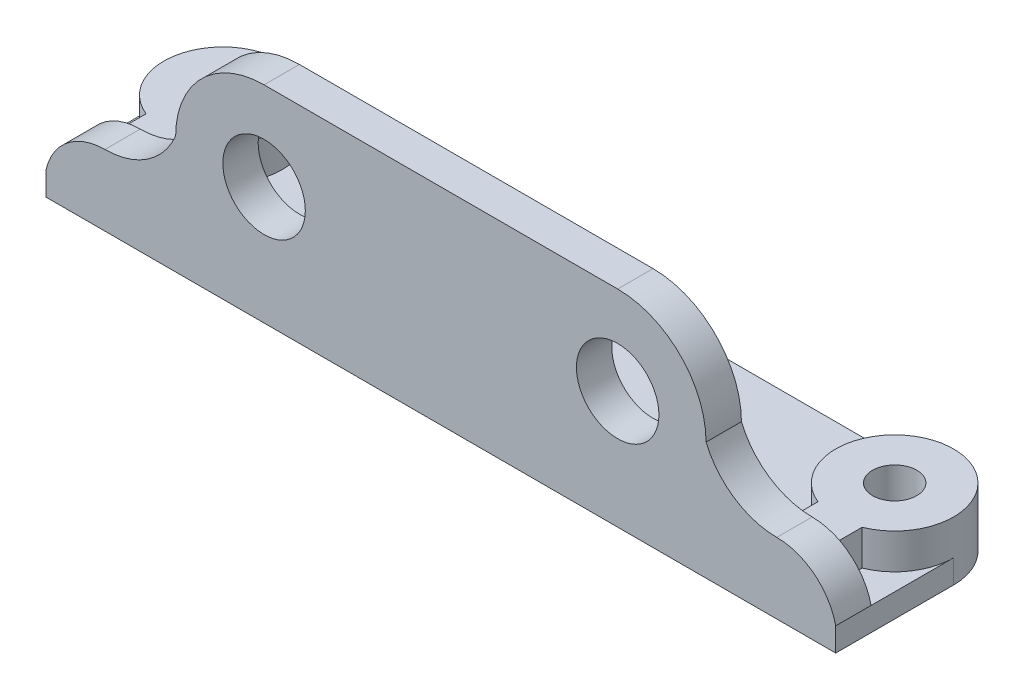
ISO-10303-21;
HEADER;
FILE_DESCRIPTION(('STEP AP214'),'2;1');
FILE_NAME('part.step','',(''),(''),'','','');
FILE_SCHEMA(('AUTOMOTIVE_DESIGN { 1 0 10303 214 1 1 1 1 }'));
ENDSEC;
DATA;
#1=APPLICATION_CONTEXT('core data for automotive mechanical design processes');
#2=APPLICATION_PROTOCOL_DEFINITION('international standard','automotive_design',2000,#1);
#3=PRODUCT_CONTEXT('',#1,'mechanical');
#4=PRODUCT('Part','Part','',(#3));
#5=PRODUCT_RELATED_PRODUCT_CATEGORY('part','',(#4));
#6=PRODUCT_DEFINITION_FORMATION('','',#4);
#7=PRODUCT_DEFINITION_CONTEXT('part definition',#1,'design');
#8=PRODUCT_DEFINITION('design','',#6,#7);
#9=PRODUCT_DEFINITION_SHAPE('','',#8);
#10=(LENGTH_UNIT() NAMED_UNIT(*) SI_UNIT(.MILLI.,.METRE.));
#11=(NAMED_UNIT(*) PLANE_ANGLE_UNIT() SI_UNIT($,.RADIAN.));
#12=(NAMED_UNIT(*) SI_UNIT($,.STERADIAN.) SOLID_ANGLE_UNIT());
#13=UNCERTAINTY_MEASURE_WITH_UNIT(LENGTH_MEASURE(1.E-05),#10,'distance_accuracy_value','');
#14=(GEOMETRIC_REPRESENTATION_CONTEXT(3) GLOBAL_UNCERTAINTY_ASSIGNED_CONTEXT((#13)) GLOBAL_UNIT_ASSIGNED_CONTEXT((#10,
#11,#12)) REPRESENTATION_CONTEXT('',''));
#15=CARTESIAN_POINT('',(0.,0.,0.));
#16=DIRECTION('',(0.,0.,1.));
#17=DIRECTION('',(1.,0.,0.));
#18=AXIS2_PLACEMENT_3D('',#15,#16,#17);
#19=CARTESIAN_POINT('',(-5.,2.,0.));
#20=DIRECTION('',(1.,0.,0.));
#21=DIRECTION('',(0.,0.,-1.));
#22=AXIS2_PLACEMENT_3D('',#19,#20,#21);
#23=PLANE('',#22);
#24=DIRECTION('',(0.,0.,1.));
#25=VECTOR('',#24,1.);
#26=CARTESIAN_POINT('',(-5.,2.,-5.001));
#27=LINE('',#26,#25);
#28=CARTESIAN_POINT('',(-5.,2.,7.));
#29=VERTEX_POINT('',#28);
#30=CARTESIAN_POINT('',(-5.,2.,10.));
#31=VERTEX_POINT('',#30);
#32=EDGE_CURVE('E297',#29,#31,#27,.T.);
#33=ORIENTED_EDGE('',*,*,#32,.F.);
#34=DIRECTION('',(0.,0.,1.));
#35=VECTOR('',#34,1.);
#36=CARTESIAN_POINT('',(-5.,2.,0.));
#37=LINE('',#36,#35);
#38=CARTESIAN_POINT('',(-5.,2.,0.));
#39=VERTEX_POINT('',#38);
#40=EDGE_CURVE('E454',#39,#29,#37,.T.);
#41=ORIENTED_EDGE('',*,*,#40,.F.);
#42=DIRECTION('',(0.,-1.,0.));
#43=VECTOR('',#42,1.);
#44=CARTESIAN_POINT('',(-5.,2.,0.));
#45=LINE('',#44,#43);
#46=CARTESIAN_POINT('',(-5.,0.,0.));
#47=VERTEX_POINT('',#46);
#48=EDGE_CURVE('E502',#39,#47,#45,.T.);
#49=ORIENTED_EDGE('',*,*,#48,.T.);
#50=DIRECTION('',(0.,0.,1.));
#51=VECTOR('',#50,1.);
#52=CARTESIAN_POINT('',(-5.,0.,0.));
#53=LINE('',#52,#51);
#54=CARTESIAN_POINT('',(-5.,0.,10.));
#55=VERTEX_POINT('',#54);
#56=EDGE_CURVE('E475',#47,#55,#53,.T.);
#57=ORIENTED_EDGE('',*,*,#56,.T.);
#58=DIRECTION('',(0.,-1.,0.));
#59=VECTOR('',#58,1.);
#60=CARTESIAN_POINT('',(-5.,2.,10.));
#61=LINE('',#60,#59);
#62=EDGE_CURVE('E499',#31,#55,#61,.T.);
#63=ORIENTED_EDGE('',*,*,#62,.F.);
#64=EDGE_LOOP('',(#33,#41,#49,#57,#63));
#65=FACE_BOUND('',#64,.T.);
#66=ADVANCED_FACE('F107',(#65),#23,.F.);
#67=CARTESIAN_POINT('',(0.,2.,10.));
#68=DIRECTION('',(0.,0.,-1.));
#69=DIRECTION('',(-1.,0.,0.));
#70=AXIS2_PLACEMENT_3D('',#67,#68,#69);
#71=PLANE('',#70);
#72=CARTESIAN_POINT('',(13.5,10.,10.));
#73=DIRECTION('',(0.,0.,1.));
#74=DIRECTION('',(1.,0.,0.));
#75=AXIS2_PLACEMENT_3D('',#72,#73,#74);
#76=CIRCLE('',#75,3.5);
#77=CARTESIAN_POINT('',(17.,10.,10.));
#78=VERTEX_POINT('',#77);
#79=EDGE_CURVE('E348',#78,#78,#76,.T.);
#80=ORIENTED_EDGE('',*,*,#79,.F.);
#81=EDGE_LOOP('',(#80));
#82=FACE_BOUND('',#81,.T.);
#83=DIRECTION('',(0.,-1.,0.));
#84=VECTOR('',#83,1.);
#85=CARTESIAN_POINT('',(62.,2.,10.));
#86=LINE('',#85,#84);
#87=CARTESIAN_POINT('',(62.,2.,10.));
#88=VERTEX_POINT('',#87);
#89=CARTESIAN_POINT('',(62.,0.,10.));
#90=VERTEX_POINT('',#89);
#91=EDGE_CURVE('E496',#88,#90,#86,.T.);
#92=ORIENTED_EDGE('',*,*,#91,.F.);
#93=CARTESIAN_POINT('',(57.,0.875000000000001,10.));
#94=DIRECTION('',(0.,0.,1.));
#95=DIRECTION('',(1.,0.,0.));
#96=AXIS2_PLACEMENT_3D('',#93,#94,#95);
#97=CIRCLE('',#96,5.125);
#98=CARTESIAN_POINT('',(57.,6.,10.));
#99=VERTEX_POINT('',#98);
#100=EDGE_CURVE('E285',#99,#88,#97,.F.);
#101=ORIENTED_EDGE('',*,*,#100,.F.);
#102=CARTESIAN_POINT('',(57.,12.5,10.));
#103=DIRECTION('',(0.,0.,1.));
#104=DIRECTION('',(1.,0.,0.));
#105=AXIS2_PLACEMENT_3D('',#102,#103,#104);
#106=CIRCLE('',#105,6.50000000000001);
#107=CARTESIAN_POINT('',(51.,10.,10.));
#108=VERTEX_POINT('',#107);
#109=EDGE_CURVE('E292',#99,#108,#106,.F.);
#110=ORIENTED_EDGE('',*,*,#109,.T.);
#111=CARTESIAN_POINT('',(43.5,10.,10.));
#112=DIRECTION('',(0.,0.,1.));
#113=DIRECTION('',(1.,0.,0.));
#114=AXIS2_PLACEMENT_3D('',#111,#112,#113);
#115=CIRCLE('',#114,7.5);
#116=CARTESIAN_POINT('',(43.5,17.5,10.));
#117=VERTEX_POINT('',#116);
#118=EDGE_CURVE('E272',#117,#108,#115,.F.);
#119=ORIENTED_EDGE('',*,*,#118,.F.);
#120=DIRECTION('',(1.,0.,0.));
#121=VECTOR('',#120,1.);
#122=CARTESIAN_POINT('',(0.,17.5,10.));
#123=LINE('',#122,#121);
#124=CARTESIAN_POINT('',(13.5,17.5,10.));
#125=VERTEX_POINT('',#124);
#126=EDGE_CURVE('E325',#125,#117,#123,.T.);
#127=ORIENTED_EDGE('',*,*,#126,.F.);
#128=CARTESIAN_POINT('',(13.5,10.,10.));
#129=DIRECTION('',(0.,0.,1.));
#130=DIRECTION('',(1.,0.,0.));
#131=AXIS2_PLACEMENT_3D('',#128,#129,#130);
#132=CIRCLE('',#131,7.5);
#133=CARTESIAN_POINT('',(6.00000000000001,10.,10.));
#134=VERTEX_POINT('',#133);
#135=EDGE_CURVE('E312',#125,#134,#132,.T.);
#136=ORIENTED_EDGE('',*,*,#135,.T.);
#137=CARTESIAN_POINT('',(0.,12.5,10.));
#138=DIRECTION('',(0.,0.,1.));
#139=DIRECTION('',(1.,0.,0.));
#140=AXIS2_PLACEMENT_3D('',#137,#138,#139);
#141=CIRCLE('',#140,6.50000000000001);
#142=CARTESIAN_POINT('',(0.,6.,10.));
#143=VERTEX_POINT('',#142);
#144=EDGE_CURVE('E281',#143,#134,#141,.T.);
#145=ORIENTED_EDGE('',*,*,#144,.F.);
#146=CARTESIAN_POINT('',(0.,0.875000000000001,10.));
#147=DIRECTION('',(0.,0.,1.));
#148=DIRECTION('',(1.,0.,0.));
#149=AXIS2_PLACEMENT_3D('',#146,#147,#148);
#150=CIRCLE('',#149,5.125);
#151=EDGE_CURVE('E304',#143,#31,#150,.T.);
#152=ORIENTED_EDGE('',*,*,#151,.T.);
#153=ORIENTED_EDGE('',*,*,#62,.T.);
#154=DIRECTION('',(1.,0.,0.));
#155=VECTOR('',#154,1.);
#156=CARTESIAN_POINT('',(0.,0.,10.));
#157=LINE('',#156,#155);
#158=EDGE_CURVE('E479',#55,#90,#157,.T.);
#159=ORIENTED_EDGE('',*,*,#158,.T.);
#160=EDGE_LOOP('',(#92,#101,#110,#119,#127,#136,#145,#152,#153,#159));
#161=FACE_BOUND('',#160,.T.);
#162=CARTESIAN_POINT('',(43.5,10.,10.));
#163=DIRECTION('',(0.,0.,1.));
#164=DIRECTION('',(1.,0.,0.));
#165=AXIS2_PLACEMENT_3D('',#162,#163,#164);
#166=CIRCLE('',#165,3.5);
#167=CARTESIAN_POINT('',(47.,10.,10.));
#168=VERTEX_POINT('',#167);
#169=EDGE_CURVE('E335',#168,#168,#166,.F.);
#170=ORIENTED_EDGE('',*,*,#169,.T.);
#171=EDGE_LOOP('',(#170));
#172=FACE_BOUND('',#171,.T.);
#173=ADVANCED_FACE('F548',(#82,#161,#172),#71,.F.);
#174=CARTESIAN_POINT('',(0.,5.,7.));
#175=DIRECTION('',(0.,0.,-1.));
#176=DIRECTION('',(-1.,0.,0.));
#177=AXIS2_PLACEMENT_3D('',#174,#175,#176);
#178=PLANE('',#177);
#179=CARTESIAN_POINT('',(13.5,10.,7.));
#180=DIRECTION('',(0.,0.,-1.));
#181=DIRECTION('',(-1.,0.,0.));
#182=AXIS2_PLACEMENT_3D('',#179,#180,#181);
#183=CIRCLE('',#182,3.5);
#184=CARTESIAN_POINT('',(10.,10.,7.));
#185=VERTEX_POINT('',#184);
#186=EDGE_CURVE('E347',#185,#185,#183,.F.);
#187=ORIENTED_EDGE('',*,*,#186,.T.);
#188=EDGE_LOOP('',(#187));
#189=FACE_BOUND('',#188,.T.);
#190=CARTESIAN_POINT('',(57.,0.875000000000001,7.));
#191=DIRECTION('',(0.,0.,-1.));
#192=DIRECTION('',(-1.,0.,0.));
#193=AXIS2_PLACEMENT_3D('',#190,#191,#192);
#194=CIRCLE('',#193,5.125);
#195=CARTESIAN_POINT('',(57.,6.,7.));
#196=VERTEX_POINT('',#195);
#197=CARTESIAN_POINT('',(62.,2.,7.));
#198=VERTEX_POINT('',#197);
#199=EDGE_CURVE('E298',#196,#198,#194,.T.);
#200=ORIENTED_EDGE('',*,*,#199,.T.);
#201=DIRECTION('',(1.,0.,0.));
#202=VECTOR('',#201,1.);
#203=CARTESIAN_POINT('',(0.,2.,7.));
#204=LINE('',#203,#202);
#205=CARTESIAN_POINT('',(58.875,2.,7.));
#206=VERTEX_POINT('',#205);
#207=EDGE_CURVE('E413',#206,#198,#204,.T.);
#208=ORIENTED_EDGE('',*,*,#207,.F.);
#209=DIRECTION('',(0.,-1.,0.));
#210=VECTOR('',#209,1.);
#211=CARTESIAN_POINT('',(58.875,5.,7.));
#212=LINE('',#211,#210);
#213=CARTESIAN_POINT('',(58.875,5.,7.));
#214=VERTEX_POINT('',#213);
#215=EDGE_CURVE('E421',#214,#206,#212,.T.);
#216=ORIENTED_EDGE('',*,*,#215,.F.);
#217=DIRECTION('',(-1.,0.,0.));
#218=VECTOR('',#217,1.);
#219=CARTESIAN_POINT('',(-5.,5.,7.));
#220=LINE('',#219,#218);
#221=CARTESIAN_POINT('',(55.125,5.,7.));
#222=VERTEX_POINT('',#221);
#223=EDGE_CURVE('E12',#214,#222,#220,.T.);
#224=ORIENTED_EDGE('',*,*,#223,.T.);
#225=DIRECTION('',(0.,-1.,0.));
#226=VECTOR('',#225,1.);
#227=CARTESIAN_POINT('',(55.125,5.,7.));
#228=LINE('',#227,#226);
#229=CARTESIAN_POINT('',(55.125,2.,7.));
#230=VERTEX_POINT('',#229);
#231=EDGE_CURVE('E441',#222,#230,#228,.T.);
#232=ORIENTED_EDGE('',*,*,#231,.T.);
#233=DIRECTION('',(1.,0.,0.));
#234=VECTOR('',#233,1.);
#235=CARTESIAN_POINT('',(0.,2.,7.));
#236=LINE('',#235,#234);
#237=CARTESIAN_POINT('',(1.875,2.,7.));
#238=VERTEX_POINT('',#237);
#239=EDGE_CURVE('E395',#238,#230,#236,.T.);
#240=ORIENTED_EDGE('',*,*,#239,.F.);
#241=DIRECTION('',(0.,-1.,0.));
#242=VECTOR('',#241,1.);
#243=CARTESIAN_POINT('',(1.875,5.,7.));
#244=LINE('',#243,#242);
#245=CARTESIAN_POINT('',(1.875,5.,7.));
#246=VERTEX_POINT('',#245);
#247=EDGE_CURVE('E437',#246,#238,#244,.T.);
#248=ORIENTED_EDGE('',*,*,#247,.F.);
#249=CARTESIAN_POINT('',(-1.875,5.,7.));
#250=VERTEX_POINT('',#249);
#251=EDGE_CURVE('E117',#246,#250,#220,.T.);
#252=ORIENTED_EDGE('',*,*,#251,.T.);
#253=DIRECTION('',(0.,-1.,0.));
#254=VECTOR('',#253,1.);
#255=CARTESIAN_POINT('',(-1.875,5.,7.));
#256=LINE('',#255,#254);
#257=CARTESIAN_POINT('',(-1.875,2.,7.));
#258=VERTEX_POINT('',#257);
#259=EDGE_CURVE('E425',#250,#258,#256,.T.);
#260=ORIENTED_EDGE('',*,*,#259,.T.);
#261=DIRECTION('',(1.,0.,0.));
#262=VECTOR('',#261,1.);
#263=CARTESIAN_POINT('',(0.,2.,7.));
#264=LINE('',#263,#262);
#265=EDGE_CURVE('E410',#29,#258,#264,.T.);
#266=ORIENTED_EDGE('',*,*,#265,.F.);
#267=CARTESIAN_POINT('',(0.,0.875000000000001,7.));
#268=DIRECTION('',(0.,0.,-1.));
#269=DIRECTION('',(-1.,0.,0.));
#270=AXIS2_PLACEMENT_3D('',#267,#268,#269);
#271=CIRCLE('',#270,5.125);
#272=CARTESIAN_POINT('',(0.,6.,7.));
#273=VERTEX_POINT('',#272);
#274=EDGE_CURVE('E265',#273,#29,#271,.F.);
#275=ORIENTED_EDGE('',*,*,#274,.F.);
#276=CARTESIAN_POINT('',(0.,12.5,7.));
#277=DIRECTION('',(0.,0.,-1.));
#278=DIRECTION('',(-1.,0.,0.));
#279=AXIS2_PLACEMENT_3D('',#276,#277,#278);
#280=CIRCLE('',#279,6.50000000000001);
#281=CARTESIAN_POINT('',(6.00000000000001,10.,7.));
#282=VERTEX_POINT('',#281);
#283=EDGE_CURVE('E309',#273,#282,#280,.F.);
#284=ORIENTED_EDGE('',*,*,#283,.T.);
#285=CARTESIAN_POINT('',(13.5,10.,7.));
#286=DIRECTION('',(0.,0.,-1.));
#287=DIRECTION('',(-1.,0.,0.));
#288=AXIS2_PLACEMENT_3D('',#285,#286,#287);
#289=CIRCLE('',#288,7.5);
#290=CARTESIAN_POINT('',(13.5,17.5,7.));
#291=VERTEX_POINT('',#290);
#292=EDGE_CURVE('E264',#291,#282,#289,.F.);
#293=ORIENTED_EDGE('',*,*,#292,.F.);
#294=DIRECTION('',(1.,0.,0.));
#295=VECTOR('',#294,1.);
#296=CARTESIAN_POINT('',(0.,17.5,7.));
#297=LINE('',#296,#295);
#298=CARTESIAN_POINT('',(43.5,17.5,7.));
#299=VERTEX_POINT('',#298);
#300=EDGE_CURVE('E279',#291,#299,#297,.T.);
#301=ORIENTED_EDGE('',*,*,#300,.T.);
#302=CARTESIAN_POINT('',(43.5,10.,7.));
#303=DIRECTION('',(0.,0.,-1.));
#304=DIRECTION('',(-1.,0.,0.));
#305=AXIS2_PLACEMENT_3D('',#302,#303,#304);
#306=CIRCLE('',#305,7.5);
#307=CARTESIAN_POINT('',(51.,10.,7.));
#308=VERTEX_POINT('',#307);
#309=EDGE_CURVE('E269',#299,#308,#306,.T.);
#310=ORIENTED_EDGE('',*,*,#309,.T.);
#311=CARTESIAN_POINT('',(57.,12.5,7.));
#312=DIRECTION('',(0.,0.,-1.));
#313=DIRECTION('',(-1.,0.,0.));
#314=AXIS2_PLACEMENT_3D('',#311,#312,#313);
#315=CIRCLE('',#314,6.50000000000001);
#316=EDGE_CURVE('E253',#196,#308,#315,.T.);
#317=ORIENTED_EDGE('',*,*,#316,.F.);
#318=EDGE_LOOP('',(#200,#208,#216,#224,#232,#240,#248,#252,#260,#266,#275,#284,#293,#301,#310,#317));
#319=FACE_BOUND('',#318,.T.);
#320=CARTESIAN_POINT('',(43.5,10.,7.));
#321=DIRECTION('',(0.,0.,-1.));
#322=DIRECTION('',(-1.,0.,0.));
#323=AXIS2_PLACEMENT_3D('',#320,#321,#322);
#324=CIRCLE('',#323,3.5);
#325=CARTESIAN_POINT('',(40.,10.,7.));
#326=VERTEX_POINT('',#325);
#327=EDGE_CURVE('E343',#326,#326,#324,.T.);
#328=ORIENTED_EDGE('',*,*,#327,.F.);
#329=EDGE_LOOP('',(#328));
#330=FACE_BOUND('',#329,.T.);
#331=ADVANCED_FACE('F276',(#189,#319,#330),#178,.T.);
#332=CARTESIAN_POINT('',(0.,5.,0.));
#333=DIRECTION('',(0.,1.,0.));
#334=DIRECTION('',(0.,0.,1.));
#335=AXIS2_PLACEMENT_3D('',#332,#333,#334);
#336=PLANE('',#335);
#337=ORIENTED_EDGE('',*,*,#223,.F.);
#338=DIRECTION('',(0.,0.,1.));
#339=VECTOR('',#338,1.);
#340=CARTESIAN_POINT('',(58.875,5.,0.));
#341=LINE('',#340,#339);
#342=CARTESIAN_POINT('',(58.875,5.,4.63512405443478));
#343=VERTEX_POINT('',#342);
#344=EDGE_CURVE('E375',#343,#214,#341,.T.);
#345=ORIENTED_EDGE('',*,*,#344,.F.);
#346=CARTESIAN_POINT('',(57.,5.,0.));
#347=DIRECTION('',(0.,1.,0.));
#348=DIRECTION('',(0.,0.,1.));
#349=AXIS2_PLACEMENT_3D('',#346,#347,#348);
#350=CIRCLE('',#349,5.);
#351=CARTESIAN_POINT('',(55.125,5.,4.63512405443479));
#352=VERTEX_POINT('',#351);
#353=EDGE_CURVE('E355',#343,#352,#350,.T.);
#354=ORIENTED_EDGE('',*,*,#353,.T.);
#355=DIRECTION('',(0.,0.,1.));
#356=VECTOR('',#355,1.);
#357=CARTESIAN_POINT('',(55.125,5.,0.));
#358=LINE('',#357,#356);
#359=EDGE_CURVE('E359',#352,#222,#358,.T.);
#360=ORIENTED_EDGE('',*,*,#359,.T.);
#361=EDGE_LOOP('',(#337,#345,#354,#360));
#362=FACE_BOUND('',#361,.T.);
#363=CARTESIAN_POINT('',(57.,5.,0.));
#364=DIRECTION('',(0.,1.,0.));
#365=DIRECTION('',(0.,0.,1.));
#366=AXIS2_PLACEMENT_3D('',#363,#364,#365);
#367=CIRCLE('',#366,1.875);
#368=CARTESIAN_POINT('',(57.,5.,1.875));
#369=VERTEX_POINT('',#368);
#370=EDGE_CURVE('E379',#369,#369,#367,.F.);
#371=ORIENTED_EDGE('',*,*,#370,.T.);
#372=EDGE_LOOP('',(#371));
#373=FACE_BOUND('',#372,.T.);
#374=ADVANCED_FACE('F577',(#362,#373),#336,.T.);
#375=CARTESIAN_POINT('',(0.,2.,0.));
#376=DIRECTION('',(0.,1.,0.));
#377=DIRECTION('',(0.,0.,1.));
#378=AXIS2_PLACEMENT_3D('',#375,#376,#377);
#379=PLANE('',#378);
#380=ORIENTED_EDGE('',*,*,#40,.T.);
#381=ORIENTED_EDGE('',*,*,#265,.T.);
#382=DIRECTION('',(0.,0.,1.));
#383=VECTOR('',#382,1.);
#384=CARTESIAN_POINT('',(-1.875,2.,0.));
#385=LINE('',#384,#383);
#386=CARTESIAN_POINT('',(-1.875,2.,4.63512405443479));
#387=VERTEX_POINT('',#386);
#388=EDGE_CURVE('E405',#387,#258,#385,.T.);
#389=ORIENTED_EDGE('',*,*,#388,.F.);
#390=CARTESIAN_POINT('',(0.,2.,0.));
#391=DIRECTION('',(0.,1.,0.));
#392=DIRECTION('',(0.,0.,1.));
#393=AXIS2_PLACEMENT_3D('',#390,#391,#392);
#394=CIRCLE('',#393,5.);
#395=EDGE_CURVE('E406',#39,#387,#394,.T.);
#396=ORIENTED_EDGE('',*,*,#395,.F.);
#397=EDGE_LOOP('',(#380,#381,#389,#396));
#398=FACE_BOUND('',#397,.T.);
#399=ADVANCED_FACE('F534',(#398),#379,.T.);
#400=CARTESIAN_POINT('',(57.,2.,0.));
#401=DIRECTION('',(0.,1.,0.));
#402=DIRECTION('',(0.,0.,1.));
#403=AXIS2_PLACEMENT_3D('',#400,#401,#402);
#404=CIRCLE('',#403,5.);
#405=CARTESIAN_POINT('',(58.875,2.,4.63512405443478));
#406=VERTEX_POINT('',#405);
#407=CARTESIAN_POINT('',(62.,2.,0.));
#408=VERTEX_POINT('',#407);
#409=EDGE_CURVE('E133',#406,#408,#404,.T.);
#410=ORIENTED_EDGE('',*,*,#409,.F.);
#411=DIRECTION('',(0.,0.,1.));
#412=VECTOR('',#411,1.);
#413=CARTESIAN_POINT('',(58.875,2.,0.));
#414=LINE('',#413,#412);
#415=EDGE_CURVE('E360',#406,#206,#414,.T.);
#416=ORIENTED_EDGE('',*,*,#415,.T.);
#417=ORIENTED_EDGE('',*,*,#207,.T.);
#418=DIRECTION('',(0.,0.,1.));
#419=VECTOR('',#418,1.);
#420=CARTESIAN_POINT('',(62.,2.,0.));
#421=LINE('',#420,#419);
#422=EDGE_CURVE('E459',#408,#198,#421,.T.);
#423=ORIENTED_EDGE('',*,*,#422,.F.);
#424=EDGE_LOOP('',(#410,#416,#417,#423));
#425=FACE_BOUND('',#424,.T.);
#426=ADVANCED_FACE('F566',(#425),#379,.T.);
#427=CARTESIAN_POINT('',(57.,2.,0.));
#428=DIRECTION('',(0.,-1.,0.));
#429=DIRECTION('',(0.,0.,-1.));
#430=AXIS2_PLACEMENT_3D('',#427,#428,#429);
#431=CYLINDRICAL_SURFACE('',#430,5.);
#432=CARTESIAN_POINT('',(57.,0.,0.));
#433=DIRECTION('',(0.,1.,0.));
#434=DIRECTION('',(0.,0.,1.));
#435=AXIS2_PLACEMENT_3D('',#432,#433,#434);
#436=CIRCLE('',#435,5.);
#437=CARTESIAN_POINT('',(62.,0.,0.));
#438=VERTEX_POINT('',#437);
#439=CARTESIAN_POINT('',(57.,0.,-5.));
#440=VERTEX_POINT('',#439);
#441=EDGE_CURVE('E449',#438,#440,#436,.T.);
#442=ORIENTED_EDGE('',*,*,#441,.T.);
#443=DIRECTION('',(0.,-1.,0.));
#444=VECTOR('',#443,1.);
#445=CARTESIAN_POINT('',(57.,2.,-5.));
#446=LINE('',#445,#444);
#447=CARTESIAN_POINT('',(57.,2.,-5.));
#448=VERTEX_POINT('',#447);
#449=EDGE_CURVE('E111',#448,#440,#446,.T.);
#450=ORIENTED_EDGE('',*,*,#449,.F.);
#451=CARTESIAN_POINT('',(55.125,2.,4.63512405443479));
#452=VERTEX_POINT('',#451);
#453=EDGE_CURVE('E391',#448,#452,#404,.T.);
#454=ORIENTED_EDGE('',*,*,#453,.T.);
#455=DIRECTION('',(0.,-1.,0.));
#456=VECTOR('',#455,1.);
#457=CARTESIAN_POINT('',(55.125,5.,4.63512405443479));
#458=LINE('',#457,#456);
#459=EDGE_CURVE('E445',#352,#452,#458,.T.);
#460=ORIENTED_EDGE('',*,*,#459,.F.);
#461=ORIENTED_EDGE('',*,*,#353,.F.);
#462=DIRECTION('',(0.,-1.,0.));
#463=VECTOR('',#462,1.);
#464=CARTESIAN_POINT('',(58.875,5.,4.63512405443478));
#465=LINE('',#464,#463);
#466=EDGE_CURVE('E387',#343,#406,#465,.T.);
#467=ORIENTED_EDGE('',*,*,#466,.T.);
#468=ORIENTED_EDGE('',*,*,#409,.T.);
#469=DIRECTION('',(0.,-1.,0.));
#470=VECTOR('',#469,1.);
#471=CARTESIAN_POINT('',(62.,2.,0.));
#472=LINE('',#471,#470);
#473=EDGE_CURVE('E463',#408,#438,#472,.T.);
#474=ORIENTED_EDGE('',*,*,#473,.T.);
#475=EDGE_LOOP('',(#442,#450,#454,#460,#461,#467,#468,#474));
#476=FACE_BOUND('',#475,.T.);
#477=ADVANCED_FACE('F109',(#476),#431,.T.);
#478=CARTESIAN_POINT('',(0.,2.,-5.));
#479=DIRECTION('',(0.,0.,-1.));
#480=DIRECTION('',(-1.,0.,0.));
#481=AXIS2_PLACEMENT_3D('',#478,#479,#480);
#482=PLANE('',#481);
#483=DIRECTION('',(1.,0.,0.));
#484=VECTOR('',#483,1.);
#485=CARTESIAN_POINT('',(0.,0.,-5.));
#486=LINE('',#485,#484);
#487=CARTESIAN_POINT('',(0.,0.,-5.));
#488=VERTEX_POINT('',#487);
#489=EDGE_CURVE('E467',#488,#440,#486,.T.);
#490=ORIENTED_EDGE('',*,*,#489,.F.);
#491=DIRECTION('',(0.,-1.,0.));
#492=VECTOR('',#491,1.);
#493=CARTESIAN_POINT('',(0.,2.,-5.));
#494=LINE('',#493,#492);
#495=CARTESIAN_POINT('',(0.,2.,-5.));
#496=VERTEX_POINT('',#495);
#497=EDGE_CURVE('E504',#496,#488,#494,.T.);
#498=ORIENTED_EDGE('',*,*,#497,.F.);
#499=DIRECTION('',(1.,0.,0.));
#500=VECTOR('',#499,1.);
#501=CARTESIAN_POINT('',(0.,2.,-5.));
#502=LINE('',#501,#500);
#503=EDGE_CURVE('E450',#496,#448,#502,.T.);
#504=ORIENTED_EDGE('',*,*,#503,.T.);
#505=ORIENTED_EDGE('',*,*,#449,.T.);
#506=EDGE_LOOP('',(#490,#498,#504,#505));
#507=FACE_BOUND('',#506,.T.);
#508=ADVANCED_FACE('F590',(#507),#482,.T.);
#509=CARTESIAN_POINT('',(0.,2.,0.));
#510=DIRECTION('',(0.,-1.,0.));
#511=DIRECTION('',(0.,0.,-1.));
#512=AXIS2_PLACEMENT_3D('',#509,#510,#511);
#513=CYLINDRICAL_SURFACE('',#512,5.);
#514=CARTESIAN_POINT('',(0.,0.,0.));
#515=DIRECTION('',(0.,1.,0.));
#516=DIRECTION('',(0.,0.,1.));
#517=AXIS2_PLACEMENT_3D('',#514,#515,#516);
#518=CIRCLE('',#517,5.);
#519=EDGE_CURVE('E471',#47,#488,#518,.F.);
#520=ORIENTED_EDGE('',*,*,#519,.F.);
#521=ORIENTED_EDGE('',*,*,#48,.F.);
#522=ORIENTED_EDGE('',*,*,#395,.T.);
#523=DIRECTION('',(0.,-1.,0.));
#524=VECTOR('',#523,1.);
#525=CARTESIAN_POINT('',(-1.875,5.,4.63512405443479));
#526=LINE('',#525,#524);
#527=CARTESIAN_POINT('',(-1.875,5.,4.63512405443479));
#528=VERTEX_POINT('',#527);
#529=EDGE_CURVE('E429',#528,#387,#526,.T.);
#530=ORIENTED_EDGE('',*,*,#529,.F.);
#531=CARTESIAN_POINT('',(0.,5.,0.));
#532=DIRECTION('',(0.,1.,0.));
#533=DIRECTION('',(0.,0.,1.));
#534=AXIS2_PLACEMENT_3D('',#531,#532,#533);
#535=CIRCLE('',#534,5.);
#536=CARTESIAN_POINT('',(1.875,5.,4.63512405443479));
#537=VERTEX_POINT('',#536);
#538=EDGE_CURVE('E368',#537,#528,#535,.T.);
#539=ORIENTED_EDGE('',*,*,#538,.F.);
#540=DIRECTION('',(0.,-1.,0.));
#541=VECTOR('',#540,1.);
#542=CARTESIAN_POINT('',(1.875,5.,4.63512405443479));
#543=LINE('',#542,#541);
#544=CARTESIAN_POINT('',(1.875,2.,4.63512405443479));
#545=VERTEX_POINT('',#544);
#546=EDGE_CURVE('E433',#537,#545,#543,.T.);
#547=ORIENTED_EDGE('',*,*,#546,.T.);
#548=EDGE_CURVE('E401',#545,#496,#394,.T.);
#549=ORIENTED_EDGE('',*,*,#548,.T.);
#550=ORIENTED_EDGE('',*,*,#497,.T.);
#551=EDGE_LOOP('',(#520,#521,#522,#530,#539,#547,#549,#550));
#552=FACE_BOUND('',#551,.T.);
#553=ADVANCED_FACE('F587',(#552),#513,.T.);
#554=CARTESIAN_POINT('',(57.,2.,0.));
#555=DIRECTION('',(0.,-1.,0.));
#556=DIRECTION('',(0.,0.,-1.));
#557=AXIS2_PLACEMENT_3D('',#554,#555,#556);
#558=CYLINDRICAL_SURFACE('',#557,1.875);
#559=CARTESIAN_POINT('',(57.,0.,0.));
#560=DIRECTION('',(0.,1.,0.));
#561=DIRECTION('',(0.,0.,1.));
#562=AXIS2_PLACEMENT_3D('',#559,#560,#561);
#563=CIRCLE('',#562,1.875);
#564=CARTESIAN_POINT('',(57.,0.,1.875));
#565=VERTEX_POINT('',#564);
#566=EDGE_CURVE('E487',#565,#565,#563,.T.);
#567=ORIENTED_EDGE('',*,*,#566,.F.);
#568=EDGE_LOOP('',(#567));
#569=FACE_BOUND('',#568,.T.);
#570=ORIENTED_EDGE('',*,*,#370,.F.);
#571=EDGE_LOOP('',(#570));
#572=FACE_BOUND('',#571,.T.);
#573=ADVANCED_FACE('F589',(#569,#572),#558,.F.);
#574=CARTESIAN_POINT('',(62.,2.,0.));
#575=DIRECTION('',(1.,0.,0.));
#576=DIRECTION('',(0.,0.,-1.));
#577=AXIS2_PLACEMENT_3D('',#574,#575,#576);
#578=PLANE('',#577);
#579=DIRECTION('',(0.,0.,1.));
#580=VECTOR('',#579,1.);
#581=CARTESIAN_POINT('',(62.,2.,-5.001));
#582=LINE('',#581,#580);
#583=EDGE_CURVE('E293',#198,#88,#582,.T.);
#584=ORIENTED_EDGE('',*,*,#583,.T.);
#585=ORIENTED_EDGE('',*,*,#91,.T.);
#586=DIRECTION('',(0.,0.,1.));
#587=VECTOR('',#586,1.);
#588=CARTESIAN_POINT('',(62.,0.,0.));
#589=LINE('',#588,#587);
#590=EDGE_CURVE('E483',#438,#90,#589,.T.);
#591=ORIENTED_EDGE('',*,*,#590,.F.);
#592=ORIENTED_EDGE('',*,*,#473,.F.);
#593=ORIENTED_EDGE('',*,*,#422,.T.);
#594=EDGE_LOOP('',(#584,#585,#591,#592,#593));
#595=FACE_BOUND('',#594,.T.);
#596=ADVANCED_FACE('F564',(#595),#578,.T.);
#597=CARTESIAN_POINT('',(0.,2.,0.));
#598=DIRECTION('',(0.,-1.,0.));
#599=DIRECTION('',(0.,0.,-1.));
#600=AXIS2_PLACEMENT_3D('',#597,#598,#599);
#601=CYLINDRICAL_SURFACE('',#600,1.875);
#602=CARTESIAN_POINT('',(0.,0.,0.));
#603=DIRECTION('',(0.,1.,0.));
#604=DIRECTION('',(0.,0.,1.));
#605=AXIS2_PLACEMENT_3D('',#602,#603,#604);
#606=CIRCLE('',#605,1.875);
#607=CARTESIAN_POINT('',(0.,0.,1.875));
#608=VERTEX_POINT('',#607);
#609=EDGE_CURVE('E455',#608,#608,#606,.T.);
#610=ORIENTED_EDGE('',*,*,#609,.F.);
#611=EDGE_LOOP('',(#610));
#612=FACE_BOUND('',#611,.T.);
#613=CARTESIAN_POINT('',(0.,5.,0.));
#614=DIRECTION('',(0.,1.,0.));
#615=DIRECTION('',(0.,0.,1.));
#616=AXIS2_PLACEMENT_3D('',#613,#614,#615);
#617=CIRCLE('',#616,1.875);
#618=CARTESIAN_POINT('',(0.,5.,1.875));
#619=VERTEX_POINT('',#618);
#620=EDGE_CURVE('E383',#619,#619,#617,.F.);
#621=ORIENTED_EDGE('',*,*,#620,.F.);
#622=EDGE_LOOP('',(#621));
#623=FACE_BOUND('',#622,.T.);
#624=ADVANCED_FACE('F607',(#612,#623),#601,.F.);
#625=ORIENTED_EDGE('',*,*,#453,.F.);
#626=ORIENTED_EDGE('',*,*,#503,.F.);
#627=ORIENTED_EDGE('',*,*,#548,.F.);
#628=DIRECTION('',(0.,0.,1.));
#629=VECTOR('',#628,1.);
#630=CARTESIAN_POINT('',(1.875,2.,0.));
#631=LINE('',#630,#629);
#632=EDGE_CURVE('E398',#545,#238,#631,.T.);
#633=ORIENTED_EDGE('',*,*,#632,.T.);
#634=ORIENTED_EDGE('',*,*,#239,.T.);
#635=DIRECTION('',(0.,0.,1.));
#636=VECTOR('',#635,1.);
#637=CARTESIAN_POINT('',(55.125,2.,0.));
#638=LINE('',#637,#636);
#639=EDGE_CURVE('E390',#452,#230,#638,.T.);
#640=ORIENTED_EDGE('',*,*,#639,.F.);
#641=EDGE_LOOP('',(#625,#626,#627,#633,#634,#640));
#642=FACE_BOUND('',#641,.T.);
#643=ADVANCED_FACE('F582',(#642),#379,.T.);
#644=CARTESIAN_POINT('',(0.,0.,0.));
#645=DIRECTION('',(0.,1.,0.));
#646=DIRECTION('',(0.,0.,1.));
#647=AXIS2_PLACEMENT_3D('',#644,#645,#646);
#648=PLANE('',#647);
#649=ORIENTED_EDGE('',*,*,#441,.F.);
#650=ORIENTED_EDGE('',*,*,#590,.T.);
#651=ORIENTED_EDGE('',*,*,#158,.F.);
#652=ORIENTED_EDGE('',*,*,#56,.F.);
#653=ORIENTED_EDGE('',*,*,#519,.T.);
#654=ORIENTED_EDGE('',*,*,#489,.T.);
#655=EDGE_LOOP('',(#649,#650,#651,#652,#653,#654));
#656=FACE_BOUND('',#655,.T.);
#657=ORIENTED_EDGE('',*,*,#566,.T.);
#658=EDGE_LOOP('',(#657));
#659=FACE_BOUND('',#658,.T.);
#660=ORIENTED_EDGE('',*,*,#609,.T.);
#661=EDGE_LOOP('',(#660));
#662=FACE_BOUND('',#661,.T.);
#663=ADVANCED_FACE('F612',(#656,#659,#662),#648,.F.);
#664=CARTESIAN_POINT('',(55.125,5.,0.));
#665=DIRECTION('',(1.,0.,0.));
#666=DIRECTION('',(0.,0.,-1.));
#667=AXIS2_PLACEMENT_3D('',#664,#665,#666);
#668=PLANE('',#667);
#669=ORIENTED_EDGE('',*,*,#639,.T.);
#670=ORIENTED_EDGE('',*,*,#231,.F.);
#671=ORIENTED_EDGE('',*,*,#359,.F.);
#672=ORIENTED_EDGE('',*,*,#459,.T.);
#673=EDGE_LOOP('',(#669,#670,#671,#672));
#674=FACE_BOUND('',#673,.T.);
#675=ADVANCED_FACE('F580',(#674),#668,.F.);
#676=CARTESIAN_POINT('',(1.875,5.,0.));
#677=DIRECTION('',(1.,0.,0.));
#678=DIRECTION('',(0.,0.,-1.));
#679=AXIS2_PLACEMENT_3D('',#676,#677,#678);
#680=PLANE('',#679);
#681=ORIENTED_EDGE('',*,*,#632,.F.);
#682=ORIENTED_EDGE('',*,*,#546,.F.);
#683=DIRECTION('',(0.,0.,1.));
#684=VECTOR('',#683,1.);
#685=CARTESIAN_POINT('',(1.875,5.,0.));
#686=LINE('',#685,#684);
#687=EDGE_CURVE('E364',#537,#246,#686,.T.);
#688=ORIENTED_EDGE('',*,*,#687,.T.);
#689=ORIENTED_EDGE('',*,*,#247,.T.);
#690=EDGE_LOOP('',(#681,#682,#688,#689));
#691=FACE_BOUND('',#690,.T.);
#692=ADVANCED_FACE('F586',(#691),#680,.T.);
#693=CARTESIAN_POINT('',(-1.875,5.,0.));
#694=DIRECTION('',(1.,0.,0.));
#695=DIRECTION('',(0.,0.,-1.));
#696=AXIS2_PLACEMENT_3D('',#693,#694,#695);
#697=PLANE('',#696);
#698=ORIENTED_EDGE('',*,*,#388,.T.);
#699=ORIENTED_EDGE('',*,*,#259,.F.);
#700=DIRECTION('',(0.,0.,1.));
#701=VECTOR('',#700,1.);
#702=CARTESIAN_POINT('',(-1.875,5.,0.));
#703=LINE('',#702,#701);
#704=EDGE_CURVE('E371',#528,#250,#703,.T.);
#705=ORIENTED_EDGE('',*,*,#704,.F.);
#706=ORIENTED_EDGE('',*,*,#529,.T.);
#707=EDGE_LOOP('',(#698,#699,#705,#706));
#708=FACE_BOUND('',#707,.T.);
#709=ADVANCED_FACE('F532',(#708),#697,.F.);
#710=CARTESIAN_POINT('',(58.875,5.,0.));
#711=DIRECTION('',(1.,0.,0.));
#712=DIRECTION('',(0.,0.,-1.));
#713=AXIS2_PLACEMENT_3D('',#710,#711,#712);
#714=PLANE('',#713);
#715=ORIENTED_EDGE('',*,*,#415,.F.);
#716=ORIENTED_EDGE('',*,*,#466,.F.);
#717=ORIENTED_EDGE('',*,*,#344,.T.);
#718=ORIENTED_EDGE('',*,*,#215,.T.);
#719=EDGE_LOOP('',(#715,#716,#717,#718));
#720=FACE_BOUND('',#719,.T.);
#721=ADVANCED_FACE('F573',(#720),#714,.T.);
#722=ORIENTED_EDGE('',*,*,#251,.F.);
#723=ORIENTED_EDGE('',*,*,#687,.F.);
#724=ORIENTED_EDGE('',*,*,#538,.T.);
#725=ORIENTED_EDGE('',*,*,#704,.T.);
#726=EDGE_LOOP('',(#722,#723,#724,#725));
#727=FACE_BOUND('',#726,.T.);
#728=ORIENTED_EDGE('',*,*,#620,.T.);
#729=EDGE_LOOP('',(#728));
#730=FACE_BOUND('',#729,.T.);
#731=ADVANCED_FACE('F528',(#727,#730),#336,.T.);
#732=CARTESIAN_POINT('',(13.5,10.,-5.001));
#733=DIRECTION('',(0.,0.,1.));
#734=DIRECTION('',(1.,0.,0.));
#735=AXIS2_PLACEMENT_3D('',#732,#733,#734);
#736=CYLINDRICAL_SURFACE('',#735,3.5);
#737=ORIENTED_EDGE('',*,*,#186,.F.);
#738=EDGE_LOOP('',(#737));
#739=FACE_BOUND('',#738,.T.);
#740=ORIENTED_EDGE('',*,*,#79,.T.);
#741=EDGE_LOOP('',(#740));
#742=FACE_BOUND('',#741,.T.);
#743=ADVANCED_FACE('F631',(#739,#742),#736,.F.);
#744=CARTESIAN_POINT('',(43.5,10.,-5.001));
#745=DIRECTION('',(0.,0.,1.));
#746=DIRECTION('',(1.,0.,0.));
#747=AXIS2_PLACEMENT_3D('',#744,#745,#746);
#748=CYLINDRICAL_SURFACE('',#747,7.5);
#749=DIRECTION('',(0.,0.,1.));
#750=VECTOR('',#749,1.);
#751=CARTESIAN_POINT('',(43.5,17.5,-5.001));
#752=LINE('',#751,#750);
#753=EDGE_CURVE('E125',#299,#117,#752,.T.);
#754=ORIENTED_EDGE('',*,*,#753,.T.);
#755=ORIENTED_EDGE('',*,*,#118,.T.);
#756=DIRECTION('',(0.,0.,1.));
#757=VECTOR('',#756,1.);
#758=CARTESIAN_POINT('',(51.,10.,-5.001));
#759=LINE('',#758,#757);
#760=EDGE_CURVE('E257',#308,#108,#759,.T.);
#761=ORIENTED_EDGE('',*,*,#760,.F.);
#762=ORIENTED_EDGE('',*,*,#309,.F.);
#763=EDGE_LOOP('',(#754,#755,#761,#762));
#764=FACE_BOUND('',#763,.T.);
#765=ADVANCED_FACE('F268',(#764),#748,.T.);
#766=CARTESIAN_POINT('',(57.,12.5,-5.001));
#767=DIRECTION('',(0.,0.,1.));
#768=DIRECTION('',(1.,0.,0.));
#769=AXIS2_PLACEMENT_3D('',#766,#767,#768);
#770=CYLINDRICAL_SURFACE('',#769,6.50000000000001);
#771=ORIENTED_EDGE('',*,*,#316,.T.);
#772=ORIENTED_EDGE('',*,*,#760,.T.);
#773=ORIENTED_EDGE('',*,*,#109,.F.);
#774=DIRECTION('',(0.,0.,1.));
#775=VECTOR('',#774,1.);
#776=CARTESIAN_POINT('',(57.,6.,-5.001));
#777=LINE('',#776,#775);
#778=EDGE_CURVE('E259',#196,#99,#777,.T.);
#779=ORIENTED_EDGE('',*,*,#778,.F.);
#780=EDGE_LOOP('',(#771,#772,#773,#779));
#781=FACE_BOUND('',#780,.T.);
#782=ADVANCED_FACE('F255',(#781),#770,.F.);
#783=CARTESIAN_POINT('',(57.,0.875000000000001,-5.001));
#784=DIRECTION('',(0.,0.,1.));
#785=DIRECTION('',(1.,0.,0.));
#786=AXIS2_PLACEMENT_3D('',#783,#784,#785);
#787=CYLINDRICAL_SURFACE('',#786,5.125);
#788=ORIENTED_EDGE('',*,*,#778,.T.);
#789=ORIENTED_EDGE('',*,*,#100,.T.);
#790=ORIENTED_EDGE('',*,*,#583,.F.);
#791=ORIENTED_EDGE('',*,*,#199,.F.);
#792=EDGE_LOOP('',(#788,#789,#790,#791));
#793=FACE_BOUND('',#792,.T.);
#794=ADVANCED_FACE('F562',(#793),#787,.T.);
#795=CARTESIAN_POINT('',(0.,0.875000000000001,-5.001));
#796=DIRECTION('',(0.,0.,1.));
#797=DIRECTION('',(1.,0.,0.));
#798=AXIS2_PLACEMENT_3D('',#795,#796,#797);
#799=CYLINDRICAL_SURFACE('',#798,5.125);
#800=ORIENTED_EDGE('',*,*,#274,.T.);
#801=ORIENTED_EDGE('',*,*,#32,.T.);
#802=ORIENTED_EDGE('',*,*,#151,.F.);
#803=DIRECTION('',(0.,0.,1.));
#804=VECTOR('',#803,1.);
#805=CARTESIAN_POINT('',(0.,6.,-5.001));
#806=LINE('',#805,#804);
#807=EDGE_CURVE('E301',#273,#143,#806,.T.);
#808=ORIENTED_EDGE('',*,*,#807,.F.);
#809=EDGE_LOOP('',(#800,#801,#802,#808));
#810=FACE_BOUND('',#809,.T.);
#811=ADVANCED_FACE('F540',(#810),#799,.T.);
#812=CARTESIAN_POINT('',(0.,12.5,-5.001));
#813=DIRECTION('',(0.,0.,1.));
#814=DIRECTION('',(1.,0.,0.));
#815=AXIS2_PLACEMENT_3D('',#812,#813,#814);
#816=CYLINDRICAL_SURFACE('',#815,6.50000000000001);
#817=ORIENTED_EDGE('',*,*,#807,.T.);
#818=ORIENTED_EDGE('',*,*,#144,.T.);
#819=DIRECTION('',(0.,0.,1.));
#820=VECTOR('',#819,1.);
#821=CARTESIAN_POINT('',(6.00000000000001,10.,-5.001));
#822=LINE('',#821,#820);
#823=EDGE_CURVE('E305',#282,#134,#822,.T.);
#824=ORIENTED_EDGE('',*,*,#823,.F.);
#825=ORIENTED_EDGE('',*,*,#283,.F.);
#826=EDGE_LOOP('',(#817,#818,#824,#825));
#827=FACE_BOUND('',#826,.T.);
#828=ADVANCED_FACE('F555',(#827),#816,.F.);
#829=CARTESIAN_POINT('',(13.5,10.,-5.001));
#830=DIRECTION('',(0.,0.,1.));
#831=DIRECTION('',(1.,0.,0.));
#832=AXIS2_PLACEMENT_3D('',#829,#830,#831);
#833=CYLINDRICAL_SURFACE('',#832,7.5);
#834=ORIENTED_EDGE('',*,*,#292,.T.);
#835=ORIENTED_EDGE('',*,*,#823,.T.);
#836=ORIENTED_EDGE('',*,*,#135,.F.);
#837=DIRECTION('',(0.,0.,1.));
#838=VECTOR('',#837,1.);
#839=CARTESIAN_POINT('',(13.5,17.5,-5.001));
#840=LINE('',#839,#838);
#841=EDGE_CURVE('E308',#291,#125,#840,.T.);
#842=ORIENTED_EDGE('',*,*,#841,.F.);
#843=EDGE_LOOP('',(#834,#835,#836,#842));
#844=FACE_BOUND('',#843,.T.);
#845=ADVANCED_FACE('F557',(#844),#833,.T.);
#846=CARTESIAN_POINT('',(0.,17.5,-5.001));
#847=DIRECTION('',(0.,-1.,0.));
#848=DIRECTION('',(0.,0.,-1.));
#849=AXIS2_PLACEMENT_3D('',#846,#847,#848);
#850=PLANE('',#849);
#851=ORIENTED_EDGE('',*,*,#841,.T.);
#852=ORIENTED_EDGE('',*,*,#126,.T.);
#853=ORIENTED_EDGE('',*,*,#753,.F.);
#854=ORIENTED_EDGE('',*,*,#300,.F.);
#855=EDGE_LOOP('',(#851,#852,#853,#854));
#856=FACE_BOUND('',#855,.T.);
#857=ADVANCED_FACE('F559',(#856),#850,.F.);
#858=CARTESIAN_POINT('',(43.5,10.,-5.001));
#859=DIRECTION('',(0.,0.,1.));
#860=DIRECTION('',(1.,0.,0.));
#861=AXIS2_PLACEMENT_3D('',#858,#859,#860);
#862=CYLINDRICAL_SURFACE('',#861,3.5);
#863=ORIENTED_EDGE('',*,*,#327,.T.);
#864=EDGE_LOOP('',(#863));
#865=FACE_BOUND('',#864,.T.);
#866=ORIENTED_EDGE('',*,*,#169,.F.);
#867=EDGE_LOOP('',(#866));
#868=FACE_BOUND('',#867,.T.);
#869=ADVANCED_FACE('F635',(#865,#868),#862,.F.);
#870=CLOSED_SHELL('',(#66,#173,#331,#374,#399,#426,#477,#508,#553,#573,#596,#624,#643,#663,#675,
#692,#709,#721,#731,#743,#765,#782,#794,#811,#828,#845,#857,#869));
#871=MANIFOLD_SOLID_BREP('B2',#870);
#872=ADVANCED_BREP_SHAPE_REPRESENTATION('',(#18,#871),#14);
#873=SHAPE_DEFINITION_REPRESENTATION(#9,#872);
ENDSEC;
END-ISO-10303-21;
